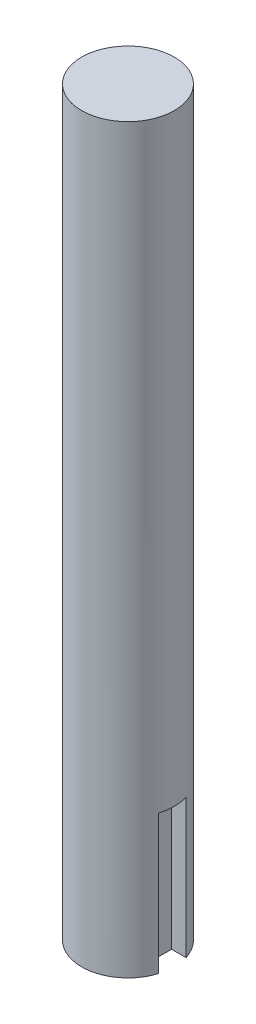
ISO-10303-21;
HEADER;
FILE_DESCRIPTION(('STEP AP214'),'2;1');
FILE_NAME('part.step','',(''),(''),'','','');
FILE_SCHEMA(('AUTOMOTIVE_DESIGN { 1 0 10303 214 1 1 1 1 }'));
ENDSEC;
DATA;
#1=APPLICATION_CONTEXT('core data for automotive mechanical design processes');
#2=APPLICATION_PROTOCOL_DEFINITION('international standard','automotive_design',2000,#1);
#3=PRODUCT_CONTEXT('',#1,'mechanical');
#4=PRODUCT('Part','Part','',(#3));
#5=PRODUCT_RELATED_PRODUCT_CATEGORY('part','',(#4));
#6=PRODUCT_DEFINITION_FORMATION('','',#4);
#7=PRODUCT_DEFINITION_CONTEXT('part definition',#1,'design');
#8=PRODUCT_DEFINITION('design','',#6,#7);
#9=PRODUCT_DEFINITION_SHAPE('','',#8);
#10=(LENGTH_UNIT() NAMED_UNIT(*) SI_UNIT(.MILLI.,.METRE.));
#11=(NAMED_UNIT(*) PLANE_ANGLE_UNIT() SI_UNIT($,.RADIAN.));
#12=(NAMED_UNIT(*) SI_UNIT($,.STERADIAN.) SOLID_ANGLE_UNIT());
#13=UNCERTAINTY_MEASURE_WITH_UNIT(LENGTH_MEASURE(1.E-05),#10,'distance_accuracy_value','');
#14=(GEOMETRIC_REPRESENTATION_CONTEXT(3) GLOBAL_UNCERTAINTY_ASSIGNED_CONTEXT((#13)) GLOBAL_UNIT_ASSIGNED_CONTEXT((#10,
#11,#12)) REPRESENTATION_CONTEXT('',''));
#15=CARTESIAN_POINT('',(0.,0.,0.));
#16=DIRECTION('',(0.,0.,1.));
#17=DIRECTION('',(1.,0.,0.));
#18=AXIS2_PLACEMENT_3D('',#15,#16,#17);
#19=CARTESIAN_POINT('',(0.,160.,0.));
#20=DIRECTION('',(0.,-1.,0.));
#21=DIRECTION('',(0.,0.,-1.));
#22=AXIS2_PLACEMENT_3D('',#19,#20,#21);
#23=CYLINDRICAL_SURFACE('',#22,10.);
#24=CARTESIAN_POINT('',(0.,160.,0.));
#25=DIRECTION('',(0.,1.,0.));
#26=DIRECTION('',(0.,0.,1.));
#27=AXIS2_PLACEMENT_3D('',#24,#25,#26);
#28=CIRCLE('',#27,10.);
#29=CARTESIAN_POINT('',(0.,160.,10.));
#30=VERTEX_POINT('',#29);
#31=EDGE_CURVE('E11',#30,#30,#28,.T.);
#32=ORIENTED_EDGE('',*,*,#31,.F.);
#33=EDGE_LOOP('',(#32));
#34=FACE_BOUND('',#33,.T.);
#35=DIRECTION('',(0.,-1.,0.));
#36=VECTOR('',#35,1.);
#37=CARTESIAN_POINT('',(9.53939201416946,30.,3.));
#38=LINE('',#37,#36);
#39=CARTESIAN_POINT('',(9.53939201416946,30.,3.));
#40=VERTEX_POINT('',#39);
#41=CARTESIAN_POINT('',(9.53939201416946,0.,3.));
#42=VERTEX_POINT('',#41);
#43=EDGE_CURVE('E103',#40,#42,#38,.T.);
#44=ORIENTED_EDGE('',*,*,#43,.F.);
#45=CARTESIAN_POINT('',(0.,30.,0.));
#46=DIRECTION('',(0.,1.,0.));
#47=DIRECTION('',(0.,0.,1.));
#48=AXIS2_PLACEMENT_3D('',#45,#46,#47);
#49=CIRCLE('',#48,10.);
#50=CARTESIAN_POINT('',(9.53939201416946,30.,-3.));
#51=VERTEX_POINT('',#50);
#52=EDGE_CURVE('E90',#40,#51,#49,.T.);
#53=ORIENTED_EDGE('',*,*,#52,.T.);
#54=DIRECTION('',(0.,-1.,0.));
#55=VECTOR('',#54,1.);
#56=CARTESIAN_POINT('',(9.53939201416946,30.,-3.));
#57=LINE('',#56,#55);
#58=CARTESIAN_POINT('',(9.53939201416946,0.,-3.));
#59=VERTEX_POINT('',#58);
#60=EDGE_CURVE('E94',#51,#59,#57,.T.);
#61=ORIENTED_EDGE('',*,*,#60,.T.);
#62=CARTESIAN_POINT('',(0.,0.,0.));
#63=DIRECTION('',(0.,1.,0.));
#64=DIRECTION('',(0.,0.,1.));
#65=AXIS2_PLACEMENT_3D('',#62,#63,#64);
#66=CIRCLE('',#65,10.);
#67=EDGE_CURVE('E48',#59,#42,#66,.T.);
#68=ORIENTED_EDGE('',*,*,#67,.T.);
#69=EDGE_LOOP('',(#44,#53,#61,#68));
#70=FACE_BOUND('',#69,.T.);
#71=ADVANCED_FACE('F45',(#34,#70),#23,.T.);
#72=CARTESIAN_POINT('',(0.,0.,0.));
#73=DIRECTION('',(0.,1.,0.));
#74=DIRECTION('',(0.,0.,1.));
#75=AXIS2_PLACEMENT_3D('',#72,#73,#74);
#76=PLANE('',#75);
#77=DIRECTION('',(1.,0.,0.));
#78=VECTOR('',#77,1.);
#79=CARTESIAN_POINT('',(0.,0.,3.));
#80=LINE('',#79,#78);
#81=CARTESIAN_POINT('',(6.40939201416946,0.,3.));
#82=VERTEX_POINT('',#81);
#83=EDGE_CURVE('E60',#82,#42,#80,.T.);
#84=ORIENTED_EDGE('',*,*,#83,.T.);
#85=ORIENTED_EDGE('',*,*,#67,.F.);
#86=DIRECTION('',(1.,0.,0.));
#87=VECTOR('',#86,1.);
#88=CARTESIAN_POINT('',(0.,0.,-3.));
#89=LINE('',#88,#87);
#90=CARTESIAN_POINT('',(6.40939201416946,0.,-3.));
#91=VERTEX_POINT('',#90);
#92=EDGE_CURVE('E98',#91,#59,#89,.T.);
#93=ORIENTED_EDGE('',*,*,#92,.F.);
#94=DIRECTION('',(0.,0.,1.));
#95=VECTOR('',#94,1.);
#96=CARTESIAN_POINT('',(6.40939201416946,0.,0.));
#97=LINE('',#96,#95);
#98=EDGE_CURVE('E113',#91,#82,#97,.T.);
#99=ORIENTED_EDGE('',*,*,#98,.T.);
#100=EDGE_LOOP('',(#84,#85,#93,#99));
#101=FACE_BOUND('',#100,.T.);
#102=ADVANCED_FACE('F133',(#101),#76,.F.);
#103=CARTESIAN_POINT('',(0.,160.,0.));
#104=DIRECTION('',(0.,1.,0.));
#105=DIRECTION('',(0.,0.,1.));
#106=AXIS2_PLACEMENT_3D('',#103,#104,#105);
#107=PLANE('',#106);
#108=ORIENTED_EDGE('',*,*,#31,.T.);
#109=EDGE_LOOP('',(#108));
#110=FACE_BOUND('',#109,.T.);
#111=ADVANCED_FACE('F137',(#110),#107,.T.);
#112=CARTESIAN_POINT('',(0.,30.,3.));
#113=DIRECTION('',(0.,0.,-1.));
#114=DIRECTION('',(-1.,0.,0.));
#115=AXIS2_PLACEMENT_3D('',#112,#113,#114);
#116=PLANE('',#115);
#117=ORIENTED_EDGE('',*,*,#83,.F.);
#118=DIRECTION('',(0.,-1.,0.));
#119=VECTOR('',#118,1.);
#120=CARTESIAN_POINT('',(6.40939201416946,30.,3.));
#121=LINE('',#120,#119);
#122=CARTESIAN_POINT('',(6.40939201416946,30.,3.));
#123=VERTEX_POINT('',#122);
#124=EDGE_CURVE('E118',#123,#82,#121,.T.);
#125=ORIENTED_EDGE('',*,*,#124,.F.);
#126=DIRECTION('',(1.,0.,0.));
#127=VECTOR('',#126,1.);
#128=CARTESIAN_POINT('',(0.,30.,3.));
#129=LINE('',#128,#127);
#130=EDGE_CURVE('E110',#123,#40,#129,.T.);
#131=ORIENTED_EDGE('',*,*,#130,.T.);
#132=ORIENTED_EDGE('',*,*,#43,.T.);
#133=EDGE_LOOP('',(#117,#125,#131,#132));
#134=FACE_BOUND('',#133,.T.);
#135=ADVANCED_FACE('F135',(#134),#116,.T.);
#136=CARTESIAN_POINT('',(0.,30.,-3.));
#137=DIRECTION('',(0.,0.,-1.));
#138=DIRECTION('',(-1.,0.,0.));
#139=AXIS2_PLACEMENT_3D('',#136,#137,#138);
#140=PLANE('',#139);
#141=ORIENTED_EDGE('',*,*,#92,.T.);
#142=ORIENTED_EDGE('',*,*,#60,.F.);
#143=DIRECTION('',(1.,0.,0.));
#144=VECTOR('',#143,1.);
#145=CARTESIAN_POINT('',(0.,30.,-3.));
#146=LINE('',#145,#144);
#147=CARTESIAN_POINT('',(6.40939201416946,30.,-3.));
#148=VERTEX_POINT('',#147);
#149=EDGE_CURVE('E96',#148,#51,#146,.T.);
#150=ORIENTED_EDGE('',*,*,#149,.F.);
#151=DIRECTION('',(0.,-1.,0.));
#152=VECTOR('',#151,1.);
#153=CARTESIAN_POINT('',(6.40939201416946,30.,-3.));
#154=LINE('',#153,#152);
#155=EDGE_CURVE('E82',#148,#91,#154,.T.);
#156=ORIENTED_EDGE('',*,*,#155,.T.);
#157=EDGE_LOOP('',(#141,#142,#150,#156));
#158=FACE_BOUND('',#157,.T.);
#159=ADVANCED_FACE('F95',(#158),#140,.F.);
#160=CARTESIAN_POINT('',(6.40939201416946,30.,0.));
#161=DIRECTION('',(1.,0.,0.));
#162=DIRECTION('',(0.,0.,-1.));
#163=AXIS2_PLACEMENT_3D('',#160,#161,#162);
#164=PLANE('',#163);
#165=ORIENTED_EDGE('',*,*,#98,.F.);
#166=ORIENTED_EDGE('',*,*,#155,.F.);
#167=DIRECTION('',(0.,0.,1.));
#168=VECTOR('',#167,1.);
#169=CARTESIAN_POINT('',(6.40939201416946,30.,0.));
#170=LINE('',#169,#168);
#171=EDGE_CURVE('E68',#148,#123,#170,.T.);
#172=ORIENTED_EDGE('',*,*,#171,.T.);
#173=ORIENTED_EDGE('',*,*,#124,.T.);
#174=EDGE_LOOP('',(#165,#166,#172,#173));
#175=FACE_BOUND('',#174,.T.);
#176=ADVANCED_FACE('F134',(#175),#164,.T.);
#177=CARTESIAN_POINT('',(0.,30.,0.));
#178=DIRECTION('',(0.,1.,0.));
#179=DIRECTION('',(0.,0.,1.));
#180=AXIS2_PLACEMENT_3D('',#177,#178,#179);
#181=PLANE('',#180);
#182=ORIENTED_EDGE('',*,*,#130,.F.);
#183=ORIENTED_EDGE('',*,*,#171,.F.);
#184=ORIENTED_EDGE('',*,*,#149,.T.);
#185=ORIENTED_EDGE('',*,*,#52,.F.);
#186=EDGE_LOOP('',(#182,#183,#184,#185));
#187=FACE_BOUND('',#186,.T.);
#188=ADVANCED_FACE('F105',(#187),#181,.F.);
#189=CLOSED_SHELL('',(#71,#102,#111,#135,#159,#176,#188));
#190=MANIFOLD_SOLID_BREP('B2',#189);
#191=ADVANCED_BREP_SHAPE_REPRESENTATION('',(#18,#190),#14);
#192=SHAPE_DEFINITION_REPRESENTATION(#9,#191);
ENDSEC;
END-ISO-10303-21;
